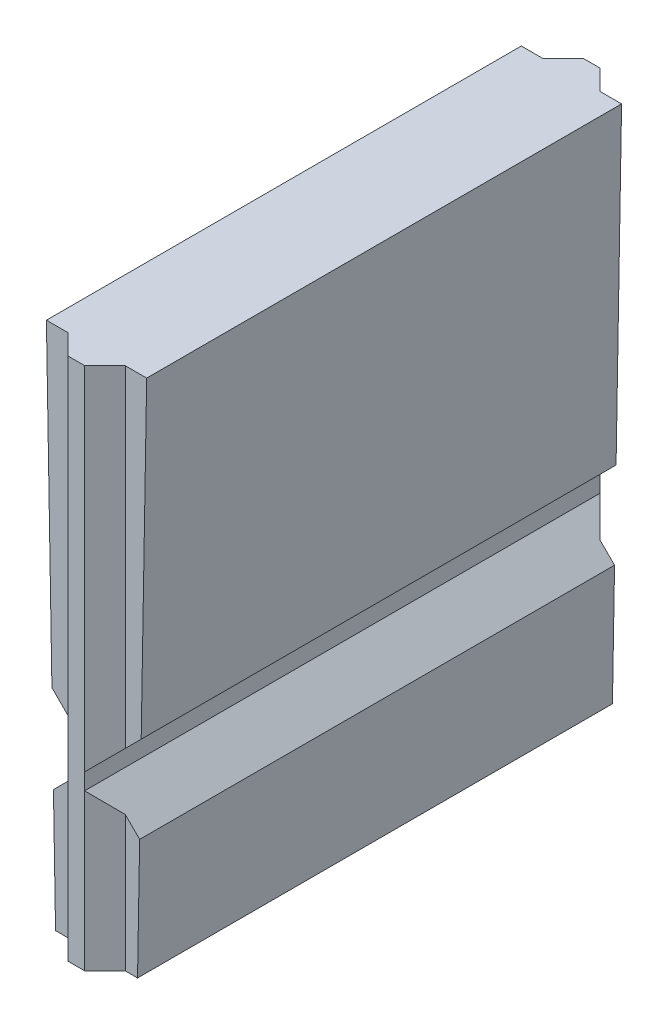
ISO-10303-21;
HEADER;
FILE_DESCRIPTION(('STEP AP214'),'2;1');
FILE_NAME('part.step','',(''),(''),'','','');
FILE_SCHEMA(('AUTOMOTIVE_DESIGN { 1 0 10303 214 1 1 1 1 }'));
ENDSEC;
DATA;
#1=APPLICATION_CONTEXT('core data for automotive mechanical design processes');
#2=APPLICATION_PROTOCOL_DEFINITION('international standard','automotive_design',2000,#1);
#3=PRODUCT_CONTEXT('',#1,'mechanical');
#4=PRODUCT('Part','Part','',(#3));
#5=PRODUCT_RELATED_PRODUCT_CATEGORY('part','',(#4));
#6=PRODUCT_DEFINITION_FORMATION('','',#4);
#7=PRODUCT_DEFINITION_CONTEXT('part definition',#1,'design');
#8=PRODUCT_DEFINITION('design','',#6,#7);
#9=PRODUCT_DEFINITION_SHAPE('','',#8);
#10=(LENGTH_UNIT() NAMED_UNIT(*) SI_UNIT(.MILLI.,.METRE.));
#11=(NAMED_UNIT(*) PLANE_ANGLE_UNIT() SI_UNIT($,.RADIAN.));
#12=(NAMED_UNIT(*) SI_UNIT($,.STERADIAN.) SOLID_ANGLE_UNIT());
#13=UNCERTAINTY_MEASURE_WITH_UNIT(LENGTH_MEASURE(1.E-05),#10,'distance_accuracy_value','');
#14=(GEOMETRIC_REPRESENTATION_CONTEXT(3) GLOBAL_UNCERTAINTY_ASSIGNED_CONTEXT((#13)) GLOBAL_UNIT_ASSIGNED_CONTEXT((#10,
#11,#12)) REPRESENTATION_CONTEXT('',''));
#15=CARTESIAN_POINT('',(0.,0.,0.));
#16=DIRECTION('',(0.,0.,1.));
#17=DIRECTION('',(1.,0.,0.));
#18=AXIS2_PLACEMENT_3D('',#15,#16,#17);
#19=CARTESIAN_POINT('',(0.,0.,0.));
#20=DIRECTION('',(0.,0.,1.));
#21=DIRECTION('',(1.,0.,0.));
#22=AXIS2_PLACEMENT_3D('',#19,#20,#21);
#23=PLANE('',#22);
#24=DIRECTION('',(0.,-1.,0.));
#25=VECTOR('',#24,1.);
#26=CARTESIAN_POINT('',(0.800099999999997,16.3016439503915,0.));
#27=LINE('',#26,#25);
#28=CARTESIAN_POINT('',(0.800099999999999,3.77518554088336,0.));
#29=VERTEX_POINT('',#28);
#30=CARTESIAN_POINT('',(0.8001,0.,0.));
#31=VERTEX_POINT('',#30);
#32=EDGE_CURVE('E389',#29,#31,#27,.T.);
#33=ORIENTED_EDGE('',*,*,#32,.F.);
#34=DIRECTION('',(0.707570214115443,-0.706643044327633,0.));
#35=VECTOR('',#34,1.);
#36=CARTESIAN_POINT('',(2.28711659590074,2.29011746801848,0.));
#37=LINE('',#36,#35);
#38=CARTESIAN_POINT('',(1.20097672519056,3.37483410743179,0.));
#39=VERTEX_POINT('',#38);
#40=EDGE_CURVE('E457',#29,#39,#37,.T.);
#41=ORIENTED_EDGE('',*,*,#40,.T.);
#42=DIRECTION('',(0.0174524064372836,0.999847695156391,0.));
#43=VECTOR('',#42,1.);
#44=CARTESIAN_POINT('',(1.14206877672338,0.,0.));
#45=LINE('',#44,#43);
#46=CARTESIAN_POINT('',(1.14206877672338,0.,0.));
#47=VERTEX_POINT('',#46);
#48=EDGE_CURVE('E262',#47,#39,#45,.T.);
#49=ORIENTED_EDGE('',*,*,#48,.F.);
#50=DIRECTION('',(1.,0.,0.));
#51=VECTOR('',#50,1.);
#52=CARTESIAN_POINT('',(-1.14206877672349,0.,0.));
#53=LINE('',#52,#51);
#54=EDGE_CURVE('E351',#31,#47,#53,.T.);
#55=ORIENTED_EDGE('',*,*,#54,.F.);
#56=EDGE_LOOP('',(#33,#41,#49,#55));
#57=FACE_BOUND('',#56,.T.);
#58=ADVANCED_FACE('F32',(#57),#23,.F.);
#59=CARTESIAN_POINT('',(0.,0.,13.2334));
#60=DIRECTION('',(0.,0.,1.));
#61=DIRECTION('',(1.,0.,0.));
#62=AXIS2_PLACEMENT_3D('',#59,#60,#61);
#63=PLANE('',#62);
#64=DIRECTION('',(0.707570214115443,-0.706643044327633,0.));
#65=VECTOR('',#64,1.);
#66=CARTESIAN_POINT('',(2.28711659590074,2.29011746801848,13.2334));
#67=LINE('',#66,#65);
#68=CARTESIAN_POINT('',(0.800099999999999,3.77518554088336,13.2334));
#69=VERTEX_POINT('',#68);
#70=CARTESIAN_POINT('',(1.20097672519056,3.37483410743179,13.2334));
#71=VERTEX_POINT('',#70);
#72=EDGE_CURVE('E452',#69,#71,#67,.T.);
#73=ORIENTED_EDGE('',*,*,#72,.F.);
#74=DIRECTION('',(0.,-1.,0.));
#75=VECTOR('',#74,1.);
#76=CARTESIAN_POINT('',(0.800099999999997,16.3016439503915,13.2334));
#77=LINE('',#76,#75);
#78=CARTESIAN_POINT('',(0.800099999999998,0.,13.2334));
#79=VERTEX_POINT('',#78);
#80=EDGE_CURVE('E36',#69,#79,#77,.T.);
#81=ORIENTED_EDGE('',*,*,#80,.T.);
#82=DIRECTION('',(1.,0.,0.));
#83=VECTOR('',#82,1.);
#84=CARTESIAN_POINT('',(-1.14206877672349,0.,13.2334));
#85=LINE('',#84,#83);
#86=CARTESIAN_POINT('',(1.14206877672338,0.,13.2334));
#87=VERTEX_POINT('',#86);
#88=EDGE_CURVE('E284',#79,#87,#85,.T.);
#89=ORIENTED_EDGE('',*,*,#88,.T.);
#90=DIRECTION('',(0.0174524064372836,0.999847695156391,0.));
#91=VECTOR('',#90,1.);
#92=CARTESIAN_POINT('',(1.14206877672338,0.,13.2334));
#93=LINE('',#92,#91);
#94=EDGE_CURVE('E289',#87,#71,#93,.T.);
#95=ORIENTED_EDGE('',*,*,#94,.T.);
#96=EDGE_LOOP('',(#73,#81,#89,#95));
#97=FACE_BOUND('',#96,.T.);
#98=ADVANCED_FACE('F475',(#97),#63,.T.);
#99=CARTESIAN_POINT('',(1.14206877672338,0.,13.2334));
#100=DIRECTION('',(-0.999847695156391,0.0174524064372836,0.));
#101=DIRECTION('',(-0.0174524064372836,-0.999847695156391,0.));
#102=AXIS2_PLACEMENT_3D('',#99,#100,#101);
#103=PLANE('',#102);
#104=ORIENTED_EDGE('',*,*,#48,.T.);
#105=DIRECTION('',(0.,0.,1.));
#106=VECTOR('',#105,1.);
#107=CARTESIAN_POINT('',(1.20097672519056,3.37483410743179,-3.20387470582324));
#108=LINE('',#107,#106);
#109=EDGE_CURVE('E464',#39,#71,#108,.T.);
#110=ORIENTED_EDGE('',*,*,#109,.T.);
#111=ORIENTED_EDGE('',*,*,#94,.F.);
#112=DIRECTION('',(0.,0.,-1.));
#113=VECTOR('',#112,1.);
#114=CARTESIAN_POINT('',(1.14206877672338,0.,13.2334));
#115=LINE('',#114,#113);
#116=EDGE_CURVE('E272',#87,#47,#115,.T.);
#117=ORIENTED_EDGE('',*,*,#116,.T.);
#118=EDGE_LOOP('',(#104,#110,#111,#117));
#119=FACE_BOUND('',#118,.T.);
#120=ADVANCED_FACE('F470',(#119),#103,.F.);
#121=CARTESIAN_POINT('',(0.800099999999997,16.3016439503915,13.2334));
#122=DIRECTION('',(0.703928821146213,0.,0.710270522237621));
#123=DIRECTION('',(0.710270522237621,0.,-0.703928821146213));
#124=AXIS2_PLACEMENT_3D('',#121,#122,#123);
#125=PLANE('',#124);
#126=DIRECTION('',(0.579322980497767,-0.57856386040737,-0.574150453886179));
#127=VECTOR('',#126,1.);
#128=CARTESIAN_POINT('',(-3.3984599566469,7.9682438838862,17.3944728141768));
#129=LINE('',#128,#127);
#130=CARTESIAN_POINT('',(0.231139999999997,4.3434,13.79728));
#131=VERTEX_POINT('',#130);
#132=EDGE_CURVE('E455',#131,#69,#129,.T.);
#133=ORIENTED_EDGE('',*,*,#132,.F.);
#134=DIRECTION('',(0.,-1.,0.));
#135=VECTOR('',#134,1.);
#136=CARTESIAN_POINT('',(0.231139999999997,16.3016439503915,13.79728));
#137=LINE('',#136,#135);
#138=CARTESIAN_POINT('',(0.23114,0.,13.79728));
#139=VERTEX_POINT('',#138);
#140=EDGE_CURVE('E223',#131,#139,#137,.T.);
#141=ORIENTED_EDGE('',*,*,#140,.T.);
#142=DIRECTION('',(-0.710270522237621,0.,0.703928821146213));
#143=VECTOR('',#142,1.);
#144=CARTESIAN_POINT('',(0.8001,0.,13.2334));
#145=LINE('',#144,#143);
#146=EDGE_CURVE('E245',#79,#139,#145,.T.);
#147=ORIENTED_EDGE('',*,*,#146,.F.);
#148=ORIENTED_EDGE('',*,*,#80,.F.);
#149=EDGE_LOOP('',(#133,#141,#147,#148));
#150=FACE_BOUND('',#149,.T.);
#151=ADVANCED_FACE('F560',(#150),#125,.T.);
#152=CARTESIAN_POINT('',(0.800099999999997,16.3016439503915,0.));
#153=DIRECTION('',(-0.703928821146213,0.,0.710270522237621));
#154=DIRECTION('',(0.710270522237621,0.,0.703928821146213));
#155=AXIS2_PLACEMENT_3D('',#152,#153,#154);
#156=PLANE('',#155);
#157=DIRECTION('',(0.,-1.,0.));
#158=VECTOR('',#157,1.);
#159=CARTESIAN_POINT('',(0.231139999999997,16.3016439503915,-0.563879999999999));
#160=LINE('',#159,#158);
#161=CARTESIAN_POINT('',(0.231139999999999,4.3434,-0.563879999999999));
#162=VERTEX_POINT('',#161);
#163=CARTESIAN_POINT('',(0.23114,0.,-0.563879999999999));
#164=VERTEX_POINT('',#163);
#165=EDGE_CURVE('E403',#162,#164,#160,.T.);
#166=ORIENTED_EDGE('',*,*,#165,.F.);
#167=DIRECTION('',(0.579322980497767,-0.57856386040737,0.574150453886179));
#168=VECTOR('',#167,1.);
#169=CARTESIAN_POINT('',(-3.3984599566469,7.9682438838862,-4.16107281417683));
#170=LINE('',#169,#168);
#171=EDGE_CURVE('E11',#162,#29,#170,.T.);
#172=ORIENTED_EDGE('',*,*,#171,.T.);
#173=ORIENTED_EDGE('',*,*,#32,.T.);
#174=DIRECTION('',(-0.710270522237621,0.,-0.703928821146213));
#175=VECTOR('',#174,1.);
#176=CARTESIAN_POINT('',(0.8001,0.,0.));
#177=LINE('',#176,#175);
#178=EDGE_CURVE('E487',#31,#164,#177,.T.);
#179=ORIENTED_EDGE('',*,*,#178,.T.);
#180=EDGE_LOOP('',(#166,#172,#173,#179));
#181=FACE_BOUND('',#180,.T.);
#182=ADVANCED_FACE('F485',(#181),#156,.F.);
#183=CARTESIAN_POINT('',(-1.397,14.605,13.2334));
#184=DIRECTION('',(0.999847695156391,0.0174524064372766,0.));
#185=DIRECTION('',(-0.0174524064372766,0.999847695156391,0.));
#186=AXIS2_PLACEMENT_3D('',#183,#184,#185);
#187=PLANE('',#186);
#188=DIRECTION('',(0.0174524064372766,-0.999847695156391,0.));
#189=VECTOR('',#188,1.);
#190=CARTESIAN_POINT('',(-1.397,14.605,0.));
#191=LINE('',#190,#189);
#192=CARTESIAN_POINT('',(-1.397,14.605,0.));
#193=VERTEX_POINT('',#192);
#194=CARTESIAN_POINT('',(-1.24353498155387,5.8129949815538,0.));
#195=VERTEX_POINT('',#194);
#196=EDGE_CURVE('E296',#193,#195,#191,.T.);
#197=ORIENTED_EDGE('',*,*,#196,.T.);
#198=DIRECTION('',(0.,0.,1.));
#199=VECTOR('',#198,1.);
#200=CARTESIAN_POINT('',(-1.24353498155387,5.8129949815538,-3.20387470582324));
#201=LINE('',#200,#199);
#202=CARTESIAN_POINT('',(-1.24353498155387,5.8129949815538,13.2334));
#203=VERTEX_POINT('',#202);
#204=EDGE_CURVE('E320',#195,#203,#201,.T.);
#205=ORIENTED_EDGE('',*,*,#204,.T.);
#206=DIRECTION('',(0.0174524064372766,-0.999847695156391,0.));
#207=VECTOR('',#206,1.);
#208=CARTESIAN_POINT('',(-1.397,14.605,13.2334));
#209=LINE('',#208,#207);
#210=CARTESIAN_POINT('',(-1.397,14.605,13.2334));
#211=VERTEX_POINT('',#210);
#212=EDGE_CURVE('E288',#211,#203,#209,.T.);
#213=ORIENTED_EDGE('',*,*,#212,.F.);
#214=DIRECTION('',(0.,0.,-1.));
#215=VECTOR('',#214,1.);
#216=CARTESIAN_POINT('',(-1.397,14.605,13.2334));
#217=LINE('',#216,#215);
#218=EDGE_CURVE('E264',#211,#193,#217,.T.);
#219=ORIENTED_EDGE('',*,*,#218,.T.);
#220=EDGE_LOOP('',(#197,#205,#213,#219));
#221=FACE_BOUND('',#220,.T.);
#222=ADVANCED_FACE('F319',(#221),#187,.F.);
#223=DIRECTION('',(-0.706218079105667,0.707994367734872,0.));
#224=VECTOR('',#223,1.);
#225=CARTESIAN_POINT('',(2.28315891870808,2.27743069626622,13.2334));
#226=LINE('',#225,#224);
#227=CARTESIAN_POINT('',(-0.800100000000002,5.36844466673556,13.2334));
#228=VERTEX_POINT('',#227);
#229=EDGE_CURVE('E359',#228,#203,#226,.T.);
#230=ORIENTED_EDGE('',*,*,#229,.F.);
#231=DIRECTION('',(0.,-1.,0.));
#232=VECTOR('',#231,1.);
#233=CARTESIAN_POINT('',(-0.800100000000003,16.3016439503915,13.2334));
#234=LINE('',#233,#232);
#235=CARTESIAN_POINT('',(-0.800100000000001,14.605,13.2334));
#236=VERTEX_POINT('',#235);
#237=EDGE_CURVE('E310',#236,#228,#234,.T.);
#238=ORIENTED_EDGE('',*,*,#237,.F.);
#239=DIRECTION('',(-1.,0.,0.));
#240=VECTOR('',#239,1.);
#241=CARTESIAN_POINT('',(1.397,14.605,13.2334));
#242=LINE('',#241,#240);
#243=EDGE_CURVE('E293',#236,#211,#242,.T.);
#244=ORIENTED_EDGE('',*,*,#243,.T.);
#245=ORIENTED_EDGE('',*,*,#212,.T.);
#246=EDGE_LOOP('',(#230,#238,#244,#245));
#247=FACE_BOUND('',#246,.T.);
#248=ADVANCED_FACE('F307',(#247),#63,.T.);
#249=DIRECTION('',(0.,-1.,0.));
#250=VECTOR('',#249,1.);
#251=CARTESIAN_POINT('',(-0.800100000000003,16.3016439503915,0.));
#252=LINE('',#251,#250);
#253=CARTESIAN_POINT('',(-0.800100000000003,14.605,0.));
#254=VERTEX_POINT('',#253);
#255=CARTESIAN_POINT('',(-0.800100000000002,5.36844466673556,0.));
#256=VERTEX_POINT('',#255);
#257=EDGE_CURVE('E362',#254,#256,#252,.T.);
#258=ORIENTED_EDGE('',*,*,#257,.T.);
#259=DIRECTION('',(-0.706218079105667,0.707994367734872,0.));
#260=VECTOR('',#259,1.);
#261=CARTESIAN_POINT('',(2.28315891870808,2.27743069626622,0.));
#262=LINE('',#261,#260);
#263=EDGE_CURVE('E434',#256,#195,#262,.T.);
#264=ORIENTED_EDGE('',*,*,#263,.T.);
#265=ORIENTED_EDGE('',*,*,#196,.F.);
#266=DIRECTION('',(-1.,0.,0.));
#267=VECTOR('',#266,1.);
#268=CARTESIAN_POINT('',(1.397,14.605,0.));
#269=LINE('',#268,#267);
#270=EDGE_CURVE('E257',#254,#193,#269,.T.);
#271=ORIENTED_EDGE('',*,*,#270,.F.);
#272=EDGE_LOOP('',(#258,#264,#265,#271));
#273=FACE_BOUND('',#272,.T.);
#274=ADVANCED_FACE('F517',(#273),#23,.F.);
#275=CARTESIAN_POINT('',(-0.233680000000003,16.3016439503915,13.79728));
#276=DIRECTION('',(-0.705515995805001,0.,0.708693995786106));
#277=DIRECTION('',(0.708693995786106,0.,0.705515995805001));
#278=AXIS2_PLACEMENT_3D('',#275,#276,#277);
#279=PLANE('',#278);
#280=DIRECTION('',(-0.577727045948372,0.579180152308665,-0.57513634170645));
#281=VECTOR('',#280,1.);
#282=CARTESIAN_POINT('',(-4.0820217565427,8.65862115431753,9.96619538137902));
#283=LINE('',#282,#281);
#284=CARTESIAN_POINT('',(-0.233680000000003,4.8006,13.79728));
#285=VERTEX_POINT('',#284);
#286=EDGE_CURVE('E432',#285,#228,#283,.T.);
#287=ORIENTED_EDGE('',*,*,#286,.F.);
#288=DIRECTION('',(0.,-1.,0.));
#289=VECTOR('',#288,1.);
#290=CARTESIAN_POINT('',(-0.233680000000003,16.3016439503915,13.79728));
#291=LINE('',#290,#289);
#292=CARTESIAN_POINT('',(-0.233680000000003,14.605,13.79728));
#293=VERTEX_POINT('',#292);
#294=EDGE_CURVE('E231',#293,#285,#291,.T.);
#295=ORIENTED_EDGE('',*,*,#294,.F.);
#296=DIRECTION('',(0.708693995786106,0.,0.705515995805001));
#297=VECTOR('',#296,1.);
#298=CARTESIAN_POINT('',(-0.233680000000003,14.605,13.79728));
#299=LINE('',#298,#297);
#300=EDGE_CURVE('E343',#236,#293,#299,.T.);
#301=ORIENTED_EDGE('',*,*,#300,.F.);
#302=ORIENTED_EDGE('',*,*,#237,.T.);
#303=EDGE_LOOP('',(#287,#295,#301,#302));
#304=FACE_BOUND('',#303,.T.);
#305=ADVANCED_FACE('F431',(#304),#279,.T.);
#306=CARTESIAN_POINT('',(-0.233680000000003,16.3016439503915,-0.563879999999999));
#307=DIRECTION('',(0.705515995805001,0.,0.708693995786106));
#308=DIRECTION('',(0.708693995786106,0.,-0.705515995805001));
#309=AXIS2_PLACEMENT_3D('',#306,#307,#308);
#310=PLANE('',#309);
#311=DIRECTION('',(0.,-1.,0.));
#312=VECTOR('',#311,1.);
#313=CARTESIAN_POINT('',(-0.233680000000003,16.3016439503915,-0.563879999999999));
#314=LINE('',#313,#312);
#315=CARTESIAN_POINT('',(-0.233680000000003,14.605,-0.563879999999999));
#316=VERTEX_POINT('',#315);
#317=CARTESIAN_POINT('',(-0.233680000000001,4.8006,-0.563879999999999));
#318=VERTEX_POINT('',#317);
#319=EDGE_CURVE('E404',#316,#318,#314,.T.);
#320=ORIENTED_EDGE('',*,*,#319,.T.);
#321=DIRECTION('',(-0.577727045948372,0.579180152308665,0.57513634170645));
#322=VECTOR('',#321,1.);
#323=CARTESIAN_POINT('',(-4.0820217565427,8.65862115431753,3.26720461862098));
#324=LINE('',#323,#322);
#325=EDGE_CURVE('E384',#318,#256,#324,.T.);
#326=ORIENTED_EDGE('',*,*,#325,.T.);
#327=ORIENTED_EDGE('',*,*,#257,.F.);
#328=DIRECTION('',(0.708693995786106,0.,-0.705515995805001));
#329=VECTOR('',#328,1.);
#330=CARTESIAN_POINT('',(-0.233680000000003,14.605,-0.563879999999999));
#331=LINE('',#330,#329);
#332=EDGE_CURVE('E367',#254,#316,#331,.T.);
#333=ORIENTED_EDGE('',*,*,#332,.T.);
#334=EDGE_LOOP('',(#320,#326,#327,#333));
#335=FACE_BOUND('',#334,.T.);
#336=ADVANCED_FACE('F515',(#335),#310,.F.);
#337=CARTESIAN_POINT('',(1.2435349815538,5.8129949815538,0.));
#338=VERTEX_POINT('',#337);
#339=CARTESIAN_POINT('',(1.397,14.605,0.));
#340=VERTEX_POINT('',#339);
#341=EDGE_CURVE('E350',#338,#340,#45,.T.);
#342=ORIENTED_EDGE('',*,*,#341,.F.);
#343=DIRECTION('',(-0.707106781186551,-0.707106781186544,0.));
#344=VECTOR('',#343,1.);
#345=CARTESIAN_POINT('',(-2.28473,2.28473000000002,0.));
#346=LINE('',#345,#344);
#347=CARTESIAN_POINT('',(0.800099999999998,5.36955999999999,0.));
#348=VERTEX_POINT('',#347);
#349=EDGE_CURVE('E206',#338,#348,#346,.T.);
#350=ORIENTED_EDGE('',*,*,#349,.T.);
#351=CARTESIAN_POINT('',(0.8001,14.605,0.));
#352=VERTEX_POINT('',#351);
#353=EDGE_CURVE('E379',#352,#348,#27,.T.);
#354=ORIENTED_EDGE('',*,*,#353,.F.);
#355=EDGE_CURVE('E252',#340,#352,#269,.T.);
#356=ORIENTED_EDGE('',*,*,#355,.F.);
#357=EDGE_LOOP('',(#342,#350,#354,#356));
#358=FACE_BOUND('',#357,.T.);
#359=ADVANCED_FACE('F502',(#358),#23,.F.);
#360=DIRECTION('',(-0.707106781186551,-0.707106781186544,0.));
#361=VECTOR('',#360,1.);
#362=CARTESIAN_POINT('',(-2.28473,2.28473000000002,13.2334));
#363=LINE('',#362,#361);
#364=CARTESIAN_POINT('',(1.2435349815538,5.8129949815538,13.2334));
#365=VERTEX_POINT('',#364);
#366=CARTESIAN_POINT('',(0.800099999999998,5.36955999999999,13.2334));
#367=VERTEX_POINT('',#366);
#368=EDGE_CURVE('E201',#365,#367,#363,.T.);
#369=ORIENTED_EDGE('',*,*,#368,.F.);
#370=CARTESIAN_POINT('',(1.397,14.605,13.2334));
#371=VERTEX_POINT('',#370);
#372=EDGE_CURVE('E283',#365,#371,#93,.T.);
#373=ORIENTED_EDGE('',*,*,#372,.T.);
#374=CARTESIAN_POINT('',(0.800099999999998,14.605,13.2334));
#375=VERTEX_POINT('',#374);
#376=EDGE_CURVE('E269',#371,#375,#242,.T.);
#377=ORIENTED_EDGE('',*,*,#376,.T.);
#378=EDGE_CURVE('E233',#375,#367,#77,.T.);
#379=ORIENTED_EDGE('',*,*,#378,.T.);
#380=EDGE_LOOP('',(#369,#373,#377,#379));
#381=FACE_BOUND('',#380,.T.);
#382=ADVANCED_FACE('F508',(#381),#63,.T.);
#383=CARTESIAN_POINT('',(-1.20097672519065,3.37483410743179,13.2334));
#384=VERTEX_POINT('',#383);
#385=CARTESIAN_POINT('',(-1.14206877672349,0.,13.2334));
#386=VERTEX_POINT('',#385);
#387=EDGE_CURVE('E256',#384,#386,#209,.T.);
#388=ORIENTED_EDGE('',*,*,#387,.F.);
#389=DIRECTION('',(0.,0.,1.));
#390=VECTOR('',#389,1.);
#391=CARTESIAN_POINT('',(-1.20097672519065,3.37483410743179,-3.20387470582324));
#392=LINE('',#391,#390);
#393=CARTESIAN_POINT('',(-1.20097672519065,3.37483410743179,0.));
#394=VERTEX_POINT('',#393);
#395=EDGE_CURVE('E340',#394,#384,#392,.T.);
#396=ORIENTED_EDGE('',*,*,#395,.F.);
#397=CARTESIAN_POINT('',(-1.14206877672349,0.,0.));
#398=VERTEX_POINT('',#397);
#399=EDGE_CURVE('E338',#394,#398,#191,.T.);
#400=ORIENTED_EDGE('',*,*,#399,.T.);
#401=DIRECTION('',(0.,0.,-1.));
#402=VECTOR('',#401,1.);
#403=CARTESIAN_POINT('',(-1.14206877672349,0.,13.2334));
#404=LINE('',#403,#402);
#405=EDGE_CURVE('E275',#386,#398,#404,.T.);
#406=ORIENTED_EDGE('',*,*,#405,.F.);
#407=EDGE_LOOP('',(#388,#396,#400,#406));
#408=FACE_BOUND('',#407,.T.);
#409=ADVANCED_FACE('F34',(#408),#187,.F.);
#410=CARTESIAN_POINT('',(-1.14206877672349,0.,13.2334));
#411=DIRECTION('',(0.,1.,0.));
#412=DIRECTION('',(-1.,0.,0.));
#413=AXIS2_PLACEMENT_3D('',#410,#411,#412);
#414=PLANE('',#413);
#415=CARTESIAN_POINT('',(-0.800100000000002,0.,0.));
#416=VERTEX_POINT('',#415);
#417=EDGE_CURVE('E344',#398,#416,#53,.T.);
#418=ORIENTED_EDGE('',*,*,#417,.T.);
#419=DIRECTION('',(-0.708693995786106,0.,0.705515995805001));
#420=VECTOR('',#419,1.);
#421=CARTESIAN_POINT('',(-0.23368,0.,-0.563879999999999));
#422=LINE('',#421,#420);
#423=CARTESIAN_POINT('',(-0.23368,0.,-0.563879999999999));
#424=VERTEX_POINT('',#423);
#425=EDGE_CURVE('E356',#424,#416,#422,.T.);
#426=ORIENTED_EDGE('',*,*,#425,.F.);
#427=DIRECTION('',(-1.,0.,0.));
#428=VECTOR('',#427,1.);
#429=CARTESIAN_POINT('',(0.23114,0.,-0.563879999999999));
#430=LINE('',#429,#428);
#431=EDGE_CURVE('E358',#164,#424,#430,.T.);
#432=ORIENTED_EDGE('',*,*,#431,.F.);
#433=ORIENTED_EDGE('',*,*,#178,.F.);
#434=ORIENTED_EDGE('',*,*,#54,.T.);
#435=ORIENTED_EDGE('',*,*,#116,.F.);
#436=ORIENTED_EDGE('',*,*,#88,.F.);
#437=ORIENTED_EDGE('',*,*,#146,.T.);
#438=DIRECTION('',(-1.,0.,0.));
#439=VECTOR('',#438,1.);
#440=CARTESIAN_POINT('',(0.23114,0.,13.79728));
#441=LINE('',#440,#439);
#442=CARTESIAN_POINT('',(-0.23368,0.,13.79728));
#443=VERTEX_POINT('',#442);
#444=EDGE_CURVE('E248',#139,#443,#441,.T.);
#445=ORIENTED_EDGE('',*,*,#444,.T.);
#446=DIRECTION('',(-0.708693995786106,0.,-0.705515995805001));
#447=VECTOR('',#446,1.);
#448=CARTESIAN_POINT('',(-0.23368,0.,13.79728));
#449=LINE('',#448,#447);
#450=CARTESIAN_POINT('',(-0.8001,0.,13.2334));
#451=VERTEX_POINT('',#450);
#452=EDGE_CURVE('E249',#443,#451,#449,.T.);
#453=ORIENTED_EDGE('',*,*,#452,.T.);
#454=EDGE_CURVE('E279',#386,#451,#85,.T.);
#455=ORIENTED_EDGE('',*,*,#454,.F.);
#456=ORIENTED_EDGE('',*,*,#405,.T.);
#457=EDGE_LOOP('',(#418,#426,#432,#433,#434,#435,#436,#437,#445,#453,#455,#456));
#458=FACE_BOUND('',#457,.T.);
#459=ADVANCED_FACE('F334',(#458),#414,.F.);
#460=ORIENTED_EDGE('',*,*,#372,.F.);
#461=DIRECTION('',(0.,0.,1.));
#462=VECTOR('',#461,1.);
#463=CARTESIAN_POINT('',(1.2435349815538,5.8129949815538,-3.20387470582324));
#464=LINE('',#463,#462);
#465=EDGE_CURVE('E214',#338,#365,#464,.T.);
#466=ORIENTED_EDGE('',*,*,#465,.F.);
#467=ORIENTED_EDGE('',*,*,#341,.T.);
#468=DIRECTION('',(0.,0.,-1.));
#469=VECTOR('',#468,1.);
#470=CARTESIAN_POINT('',(1.397,14.605,13.2334));
#471=LINE('',#470,#469);
#472=EDGE_CURVE('E268',#371,#340,#471,.T.);
#473=ORIENTED_EDGE('',*,*,#472,.F.);
#474=EDGE_LOOP('',(#460,#466,#467,#473));
#475=FACE_BOUND('',#474,.T.);
#476=ADVANCED_FACE('F506',(#475),#103,.F.);
#477=CARTESIAN_POINT('',(1.397,14.605,13.2334));
#478=DIRECTION('',(0.,-1.,0.));
#479=DIRECTION('',(0.,0.,-1.));
#480=AXIS2_PLACEMENT_3D('',#477,#478,#479);
#481=PLANE('',#480);
#482=ORIENTED_EDGE('',*,*,#355,.T.);
#483=DIRECTION('',(0.710270522237621,0.,0.703928821146213));
#484=VECTOR('',#483,1.);
#485=CARTESIAN_POINT('',(0.800099999999997,14.605,0.));
#486=LINE('',#485,#484);
#487=CARTESIAN_POINT('',(0.231139999999997,14.605,-0.563879999999999));
#488=VERTEX_POINT('',#487);
#489=EDGE_CURVE('E410',#488,#352,#486,.T.);
#490=ORIENTED_EDGE('',*,*,#489,.F.);
#491=DIRECTION('',(1.,0.,0.));
#492=VECTOR('',#491,1.);
#493=CARTESIAN_POINT('',(0.231139999999997,14.605,-0.563879999999999));
#494=LINE('',#493,#492);
#495=EDGE_CURVE('E366',#316,#488,#494,.T.);
#496=ORIENTED_EDGE('',*,*,#495,.F.);
#497=ORIENTED_EDGE('',*,*,#332,.F.);
#498=ORIENTED_EDGE('',*,*,#270,.T.);
#499=ORIENTED_EDGE('',*,*,#218,.F.);
#500=ORIENTED_EDGE('',*,*,#243,.F.);
#501=ORIENTED_EDGE('',*,*,#300,.T.);
#502=DIRECTION('',(1.,0.,0.));
#503=VECTOR('',#502,1.);
#504=CARTESIAN_POINT('',(0.231139999999997,14.605,13.79728));
#505=LINE('',#504,#503);
#506=CARTESIAN_POINT('',(0.231139999999997,14.605,13.79728));
#507=VERTEX_POINT('',#506);
#508=EDGE_CURVE('E411',#293,#507,#505,.T.);
#509=ORIENTED_EDGE('',*,*,#508,.T.);
#510=DIRECTION('',(0.710270522237621,0.,-0.703928821146213));
#511=VECTOR('',#510,1.);
#512=CARTESIAN_POINT('',(0.800099999999997,14.605,13.2334));
#513=LINE('',#512,#511);
#514=EDGE_CURVE('E228',#507,#375,#513,.T.);
#515=ORIENTED_EDGE('',*,*,#514,.T.);
#516=ORIENTED_EDGE('',*,*,#376,.F.);
#517=ORIENTED_EDGE('',*,*,#472,.T.);
#518=EDGE_LOOP('',(#482,#490,#496,#497,#498,#499,#500,#501,#509,#515,#516,#517));
#519=FACE_BOUND('',#518,.T.);
#520=ADVANCED_FACE('F313',(#519),#481,.F.);
#521=DIRECTION('',(0.706643044327633,0.707570214115444,0.));
#522=VECTOR('',#521,1.);
#523=CARTESIAN_POINT('',(-2.28869133556639,2.2856923321917,13.2334));
#524=LINE('',#523,#522);
#525=CARTESIAN_POINT('',(-0.800100000000001,3.77623681358441,13.2334));
#526=VERTEX_POINT('',#525);
#527=EDGE_CURVE('E328',#384,#526,#524,.T.);
#528=ORIENTED_EDGE('',*,*,#527,.F.);
#529=ORIENTED_EDGE('',*,*,#387,.T.);
#530=ORIENTED_EDGE('',*,*,#454,.T.);
#531=EDGE_CURVE('E387',#526,#451,#234,.T.);
#532=ORIENTED_EDGE('',*,*,#531,.F.);
#533=EDGE_LOOP('',(#528,#529,#530,#532));
#534=FACE_BOUND('',#533,.T.);
#535=ADVANCED_FACE('F325',(#534),#63,.T.);
#536=ORIENTED_EDGE('',*,*,#399,.F.);
#537=DIRECTION('',(0.706643044327633,0.707570214115444,0.));
#538=VECTOR('',#537,1.);
#539=CARTESIAN_POINT('',(-2.28869133556639,2.2856923321917,0.));
#540=LINE('',#539,#538);
#541=CARTESIAN_POINT('',(-0.800100000000001,3.77623681358441,0.));
#542=VERTEX_POINT('',#541);
#543=EDGE_CURVE('E442',#394,#542,#540,.T.);
#544=ORIENTED_EDGE('',*,*,#543,.T.);
#545=EDGE_CURVE('E347',#542,#416,#252,.T.);
#546=ORIENTED_EDGE('',*,*,#545,.T.);
#547=ORIENTED_EDGE('',*,*,#417,.F.);
#548=EDGE_LOOP('',(#536,#544,#546,#547));
#549=FACE_BOUND('',#548,.T.);
#550=ADVANCED_FACE('F345',(#549),#23,.F.);
#551=DIRECTION('',(0.577959627532363,0.578717954822958,0.575367880323697));
#552=VECTOR('',#551,1.);
#553=CARTESIAN_POINT('',(3.76606098307423,8.34838894953813,17.7790849248542));
#554=LINE('',#553,#552);
#555=CARTESIAN_POINT('',(-0.233680000000003,4.3434,13.79728));
#556=VERTEX_POINT('',#555);
#557=EDGE_CURVE('E440',#526,#556,#554,.T.);
#558=ORIENTED_EDGE('',*,*,#557,.F.);
#559=ORIENTED_EDGE('',*,*,#531,.T.);
#560=ORIENTED_EDGE('',*,*,#452,.F.);
#561=EDGE_CURVE('E229',#556,#443,#291,.T.);
#562=ORIENTED_EDGE('',*,*,#561,.F.);
#563=EDGE_LOOP('',(#558,#559,#560,#562));
#564=FACE_BOUND('',#563,.T.);
#565=ADVANCED_FACE('F420',(#564),#279,.T.);
#566=CARTESIAN_POINT('',(0.231139999999997,16.3016439503915,13.79728));
#567=DIRECTION('',(0.,0.,1.));
#568=DIRECTION('',(1.,0.,0.));
#569=AXIS2_PLACEMENT_3D('',#566,#567,#568);
#570=PLANE('',#569);
#571=ORIENTED_EDGE('',*,*,#508,.F.);
#572=ORIENTED_EDGE('',*,*,#294,.T.);
#573=DIRECTION('',(0.,1.,0.));
#574=VECTOR('',#573,1.);
#575=CARTESIAN_POINT('',(-0.233680000000003,4.8006,13.79728));
#576=LINE('',#575,#574);
#577=EDGE_CURVE('E417',#556,#285,#576,.T.);
#578=ORIENTED_EDGE('',*,*,#577,.F.);
#579=ORIENTED_EDGE('',*,*,#561,.T.);
#580=ORIENTED_EDGE('',*,*,#444,.F.);
#581=ORIENTED_EDGE('',*,*,#140,.F.);
#582=DIRECTION('',(0.,-1.,0.));
#583=VECTOR('',#582,1.);
#584=CARTESIAN_POINT('',(0.231139999999997,4.8006,13.79728));
#585=LINE('',#584,#583);
#586=CARTESIAN_POINT('',(0.231139999999997,4.8006,13.79728));
#587=VERTEX_POINT('',#586);
#588=EDGE_CURVE('E210',#587,#131,#585,.T.);
#589=ORIENTED_EDGE('',*,*,#588,.F.);
#590=EDGE_CURVE('E221',#507,#587,#137,.T.);
#591=ORIENTED_EDGE('',*,*,#590,.F.);
#592=EDGE_LOOP('',(#571,#572,#578,#579,#580,#581,#589,#591));
#593=FACE_BOUND('',#592,.T.);
#594=ADVANCED_FACE('F220',(#593),#570,.T.);
#595=DIRECTION('',(-0.579068542962989,-0.579068542962984,0.573898288115105));
#596=VECTOR('',#595,1.);
#597=CARTESIAN_POINT('',(4.46585051655244,9.03531051655241,9.60037939877392));
#598=LINE('',#597,#596);
#599=EDGE_CURVE('E195',#367,#587,#598,.T.);
#600=ORIENTED_EDGE('',*,*,#599,.F.);
#601=ORIENTED_EDGE('',*,*,#378,.F.);
#602=ORIENTED_EDGE('',*,*,#514,.F.);
#603=ORIENTED_EDGE('',*,*,#590,.T.);
#604=EDGE_LOOP('',(#600,#601,#602,#603));
#605=FACE_BOUND('',#604,.T.);
#606=ADVANCED_FACE('F226',(#605),#125,.T.);
#607=CARTESIAN_POINT('',(0.231139999999997,16.3016439503915,-0.563879999999999));
#608=DIRECTION('',(0.,0.,1.));
#609=DIRECTION('',(1.,0.,0.));
#610=AXIS2_PLACEMENT_3D('',#607,#608,#609);
#611=PLANE('',#610);
#612=ORIENTED_EDGE('',*,*,#319,.F.);
#613=ORIENTED_EDGE('',*,*,#495,.T.);
#614=CARTESIAN_POINT('',(0.231139999999997,4.8006,-0.563879999999999));
#615=VERTEX_POINT('',#614);
#616=EDGE_CURVE('E391',#488,#615,#160,.T.);
#617=ORIENTED_EDGE('',*,*,#616,.T.);
#618=DIRECTION('',(0.,1.,0.));
#619=VECTOR('',#618,1.);
#620=CARTESIAN_POINT('',(0.231139999999997,4.8006,-0.563879999999999));
#621=LINE('',#620,#619);
#622=EDGE_CURVE('E213',#162,#615,#621,.T.);
#623=ORIENTED_EDGE('',*,*,#622,.F.);
#624=ORIENTED_EDGE('',*,*,#165,.T.);
#625=ORIENTED_EDGE('',*,*,#431,.T.);
#626=CARTESIAN_POINT('',(-0.233680000000003,4.3434,-0.563879999999999));
#627=VERTEX_POINT('',#626);
#628=EDGE_CURVE('E408',#627,#424,#314,.T.);
#629=ORIENTED_EDGE('',*,*,#628,.F.);
#630=DIRECTION('',(0.,-1.,0.));
#631=VECTOR('',#630,1.);
#632=CARTESIAN_POINT('',(-0.233680000000003,4.8006,-0.563879999999999));
#633=LINE('',#632,#631);
#634=EDGE_CURVE('E444',#318,#627,#633,.T.);
#635=ORIENTED_EDGE('',*,*,#634,.F.);
#636=EDGE_LOOP('',(#612,#613,#617,#623,#624,#625,#629,#635));
#637=FACE_BOUND('',#636,.T.);
#638=ADVANCED_FACE('F402',(#637),#611,.F.);
#639=ORIENTED_EDGE('',*,*,#353,.T.);
#640=DIRECTION('',(-0.579068542962989,-0.579068542962984,-0.573898288115105));
#641=VECTOR('',#640,1.);
#642=CARTESIAN_POINT('',(4.46585051655244,9.03531051655241,3.63302060122608));
#643=LINE('',#642,#641);
#644=EDGE_CURVE('E42',#348,#615,#643,.T.);
#645=ORIENTED_EDGE('',*,*,#644,.T.);
#646=ORIENTED_EDGE('',*,*,#616,.F.);
#647=ORIENTED_EDGE('',*,*,#489,.T.);
#648=EDGE_LOOP('',(#639,#645,#646,#647));
#649=FACE_BOUND('',#648,.T.);
#650=ADVANCED_FACE('F396',(#649),#156,.F.);
#651=ORIENTED_EDGE('',*,*,#545,.F.);
#652=DIRECTION('',(0.577959627532363,0.578717954822958,-0.575367880323697));
#653=VECTOR('',#652,1.);
#654=CARTESIAN_POINT('',(3.76606098307423,8.34838894953813,-4.54568492485416));
#655=LINE('',#654,#653);
#656=EDGE_CURVE('E278',#542,#627,#655,.T.);
#657=ORIENTED_EDGE('',*,*,#656,.T.);
#658=ORIENTED_EDGE('',*,*,#628,.T.);
#659=ORIENTED_EDGE('',*,*,#425,.T.);
#660=EDGE_LOOP('',(#651,#657,#658,#659));
#661=FACE_BOUND('',#660,.T.);
#662=ADVANCED_FACE('F493',(#661),#310,.F.);
#663=CARTESIAN_POINT('',(-1.24353498155387,5.8129949815538,-3.20387470582324));
#664=DIRECTION('',(0.707994367734872,0.706218079105667,0.));
#665=DIRECTION('',(-0.706218079105667,0.707994367734872,0.));
#666=AXIS2_PLACEMENT_3D('',#663,#664,#665);
#667=PLANE('',#666);
#668=ORIENTED_EDGE('',*,*,#229,.T.);
#669=ORIENTED_EDGE('',*,*,#204,.F.);
#670=ORIENTED_EDGE('',*,*,#263,.F.);
#671=ORIENTED_EDGE('',*,*,#325,.F.);
#672=DIRECTION('',(0.,0.,1.));
#673=VECTOR('',#672,1.);
#674=CARTESIAN_POINT('',(-0.233680000000003,4.8006,-3.20387470582324));
#675=LINE('',#674,#673);
#676=EDGE_CURVE('E57',#318,#285,#675,.T.);
#677=ORIENTED_EDGE('',*,*,#676,.T.);
#678=ORIENTED_EDGE('',*,*,#286,.T.);
#679=EDGE_LOOP('',(#668,#669,#670,#671,#677,#678));
#680=FACE_BOUND('',#679,.T.);
#681=ADVANCED_FACE('F547',(#680),#667,.F.);
#682=CARTESIAN_POINT('',(-0.233680000000003,4.3434,-3.20387470582324));
#683=DIRECTION('',(0.707570214115444,-0.706643044327633,0.));
#684=DIRECTION('',(0.706643044327633,0.707570214115444,0.));
#685=AXIS2_PLACEMENT_3D('',#682,#683,#684);
#686=PLANE('',#685);
#687=ORIENTED_EDGE('',*,*,#527,.T.);
#688=ORIENTED_EDGE('',*,*,#557,.T.);
#689=DIRECTION('',(0.,0.,1.));
#690=VECTOR('',#689,1.);
#691=CARTESIAN_POINT('',(-0.233680000000003,4.3434,-3.20387470582324));
#692=LINE('',#691,#690);
#693=EDGE_CURVE('E446',#627,#556,#692,.T.);
#694=ORIENTED_EDGE('',*,*,#693,.F.);
#695=ORIENTED_EDGE('',*,*,#656,.F.);
#696=ORIENTED_EDGE('',*,*,#543,.F.);
#697=ORIENTED_EDGE('',*,*,#395,.T.);
#698=EDGE_LOOP('',(#687,#688,#694,#695,#696,#697));
#699=FACE_BOUND('',#698,.T.);
#700=ADVANCED_FACE('F552',(#699),#686,.F.);
#701=CARTESIAN_POINT('',(-0.233680000000003,4.8006,-3.20387470582324));
#702=DIRECTION('',(1.,0.,0.));
#703=DIRECTION('',(0.,0.,-1.));
#704=AXIS2_PLACEMENT_3D('',#701,#702,#703);
#705=PLANE('',#704);
#706=ORIENTED_EDGE('',*,*,#634,.T.);
#707=ORIENTED_EDGE('',*,*,#693,.T.);
#708=ORIENTED_EDGE('',*,*,#577,.T.);
#709=ORIENTED_EDGE('',*,*,#676,.F.);
#710=EDGE_LOOP('',(#706,#707,#708,#709));
#711=FACE_BOUND('',#710,.T.);
#712=ADVANCED_FACE('F605',(#711),#705,.F.);
#713=CARTESIAN_POINT('',(0.231139999999997,4.3434,-3.20387470582324));
#714=DIRECTION('',(-0.706643044327633,-0.707570214115443,0.));
#715=DIRECTION('',(0.707570214115443,-0.706643044327633,0.));
#716=AXIS2_PLACEMENT_3D('',#713,#714,#715);
#717=PLANE('',#716);
#718=ORIENTED_EDGE('',*,*,#72,.T.);
#719=ORIENTED_EDGE('',*,*,#109,.F.);
#720=ORIENTED_EDGE('',*,*,#40,.F.);
#721=ORIENTED_EDGE('',*,*,#171,.F.);
#722=DIRECTION('',(0.,0.,1.));
#723=VECTOR('',#722,1.);
#724=CARTESIAN_POINT('',(0.231139999999997,4.3434,-3.20387470582324));
#725=LINE('',#724,#723);
#726=EDGE_CURVE('E49',#162,#131,#725,.T.);
#727=ORIENTED_EDGE('',*,*,#726,.T.);
#728=ORIENTED_EDGE('',*,*,#132,.T.);
#729=EDGE_LOOP('',(#718,#719,#720,#721,#727,#728));
#730=FACE_BOUND('',#729,.T.);
#731=ADVANCED_FACE('F482',(#730),#717,.F.);
#732=CARTESIAN_POINT('',(1.2435349815538,5.8129949815538,-3.20387470582324));
#733=DIRECTION('',(-0.707106781186544,0.707106781186551,0.));
#734=DIRECTION('',(-0.707106781186551,-0.707106781186544,0.));
#735=AXIS2_PLACEMENT_3D('',#732,#733,#734);
#736=PLANE('',#735);
#737=ORIENTED_EDGE('',*,*,#368,.T.);
#738=ORIENTED_EDGE('',*,*,#599,.T.);
#739=DIRECTION('',(0.,0.,1.));
#740=VECTOR('',#739,1.);
#741=CARTESIAN_POINT('',(0.231139999999997,4.8006,-3.20387470582324));
#742=LINE('',#741,#740);
#743=EDGE_CURVE('E198',#615,#587,#742,.T.);
#744=ORIENTED_EDGE('',*,*,#743,.F.);
#745=ORIENTED_EDGE('',*,*,#644,.F.);
#746=ORIENTED_EDGE('',*,*,#349,.F.);
#747=ORIENTED_EDGE('',*,*,#465,.T.);
#748=EDGE_LOOP('',(#737,#738,#744,#745,#746,#747));
#749=FACE_BOUND('',#748,.T.);
#750=ADVANCED_FACE('F197',(#749),#736,.F.);
#751=CARTESIAN_POINT('',(0.231139999999997,4.8006,-3.20387470582324));
#752=DIRECTION('',(-1.,0.,0.));
#753=DIRECTION('',(0.,0.,1.));
#754=AXIS2_PLACEMENT_3D('',#751,#752,#753);
#755=PLANE('',#754);
#756=ORIENTED_EDGE('',*,*,#622,.T.);
#757=ORIENTED_EDGE('',*,*,#743,.T.);
#758=ORIENTED_EDGE('',*,*,#588,.T.);
#759=ORIENTED_EDGE('',*,*,#726,.F.);
#760=EDGE_LOOP('',(#756,#757,#758,#759));
#761=FACE_BOUND('',#760,.T.);
#762=ADVANCED_FACE('F209',(#761),#755,.F.);
#763=CLOSED_SHELL('',(#58,#98,#120,#151,#182,#222,#248,#274,#305,#336,#359,#382,#409,#459,#476,
#520,#535,#550,#565,#594,#606,#638,#650,#662,#681,#700,#712,#731,#750,#762));
#764=MANIFOLD_SOLID_BREP('B2',#763);
#765=ADVANCED_BREP_SHAPE_REPRESENTATION('',(#18,#764),#14);
#766=SHAPE_DEFINITION_REPRESENTATION(#9,#765);
ENDSEC;
END-ISO-10303-21;
